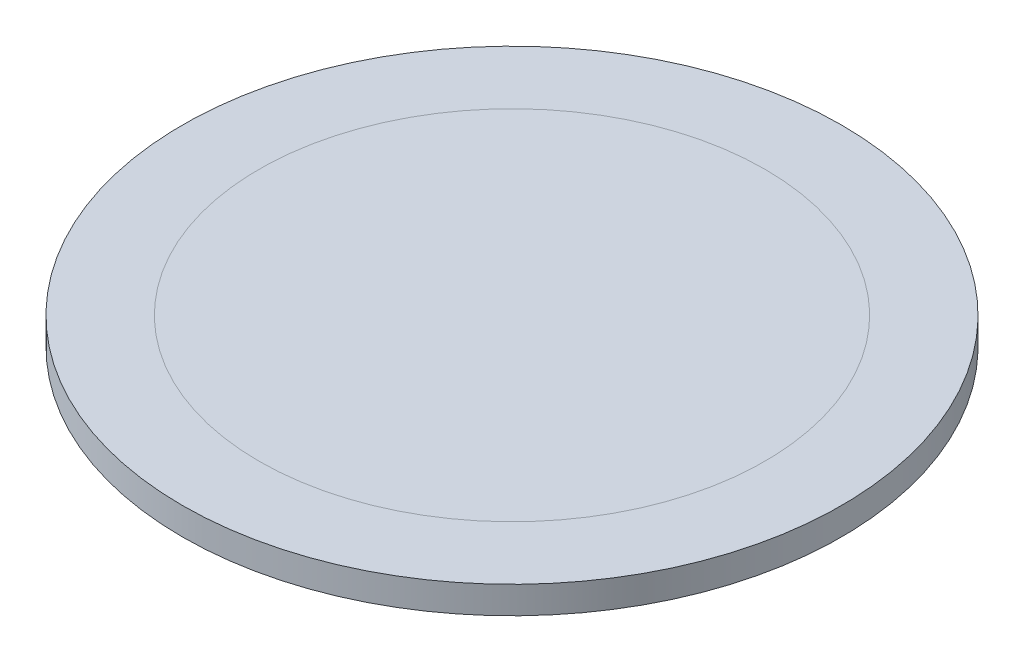
ISO-10303-21;
HEADER;
FILE_DESCRIPTION(('STEP AP214'),'2;1');
FILE_NAME('part.step','',(''),(''),'','','');
FILE_SCHEMA(('AUTOMOTIVE_DESIGN { 1 0 10303 214 1 1 1 1 }'));
ENDSEC;
DATA;
#1=APPLICATION_CONTEXT('core data for automotive mechanical design processes');
#2=APPLICATION_PROTOCOL_DEFINITION('international standard','automotive_design',2000,#1);
#3=PRODUCT_CONTEXT('',#1,'mechanical');
#4=PRODUCT('Part','Part','',(#3));
#5=PRODUCT_RELATED_PRODUCT_CATEGORY('part','',(#4));
#6=PRODUCT_DEFINITION_FORMATION('','',#4);
#7=PRODUCT_DEFINITION_CONTEXT('part definition',#1,'design');
#8=PRODUCT_DEFINITION('design','',#6,#7);
#9=PRODUCT_DEFINITION_SHAPE('','',#8);
#10=(LENGTH_UNIT() NAMED_UNIT(*) SI_UNIT(.MILLI.,.METRE.));
#11=(NAMED_UNIT(*) PLANE_ANGLE_UNIT() SI_UNIT($,.RADIAN.));
#12=(NAMED_UNIT(*) SI_UNIT($,.STERADIAN.) SOLID_ANGLE_UNIT());
#13=UNCERTAINTY_MEASURE_WITH_UNIT(LENGTH_MEASURE(1.E-05),#10,'distance_accuracy_value','');
#14=(GEOMETRIC_REPRESENTATION_CONTEXT(3) GLOBAL_UNCERTAINTY_ASSIGNED_CONTEXT((#13)) GLOBAL_UNIT_ASSIGNED_CONTEXT((#10,
#11,#12)) REPRESENTATION_CONTEXT('',''));
#15=CARTESIAN_POINT('',(0.,0.,0.));
#16=DIRECTION('',(0.,0.,1.));
#17=DIRECTION('',(1.,0.,0.));
#18=AXIS2_PLACEMENT_3D('',#15,#16,#17);
#19=CARTESIAN_POINT('',(-7.49999999999988,1.78,17.4281079622912));
#20=DIRECTION('',(0.,1.,0.));
#21=DIRECTION('',(0.,0.,1.));
#22=AXIS2_PLACEMENT_3D('',#19,#20,#21);
#23=PLANE('',#22);
#24=CARTESIAN_POINT('',(0.,1.78,0.));
#25=DIRECTION('',(0.,1.,0.));
#26=DIRECTION('',(0.,0.,1.));
#27=AXIS2_PLACEMENT_3D('',#24,#25,#26);
#28=CIRCLE('',#27,21.5);
#29=CARTESIAN_POINT('',(0.,1.78,21.5));
#30=VERTEX_POINT('',#29);
#31=EDGE_CURVE('E45',#30,#30,#28,.T.);
#32=ORIENTED_EDGE('',*,*,#31,.T.);
#33=EDGE_LOOP('',(#32));
#34=FACE_BOUND('',#33,.T.);
#35=CARTESIAN_POINT('',(0.,1.78,0.));
#36=DIRECTION('',(0.,1.,0.));
#37=DIRECTION('',(0.,0.,1.));
#38=AXIS2_PLACEMENT_3D('',#35,#36,#37);
#39=CIRCLE('',#38,16.5);
#40=CARTESIAN_POINT('',(0.,1.78,16.5));
#41=VERTEX_POINT('',#40);
#42=EDGE_CURVE('E10',#41,#41,#39,.F.);
#43=ORIENTED_EDGE('',*,*,#42,.T.);
#44=EDGE_LOOP('',(#43));
#45=FACE_BOUND('',#44,.T.);
#46=ADVANCED_FACE('F37',(#34,#45),#23,.T.);
#47=CARTESIAN_POINT('',(0.,67.5911831820431,0.));
#48=DIRECTION('',(0.,-1.,0.));
#49=DIRECTION('',(0.,0.,-1.));
#50=AXIS2_PLACEMENT_3D('',#47,#48,#49);
#51=CYLINDRICAL_SURFACE('',#50,21.5);
#52=CARTESIAN_POINT('',(0.,0.,0.));
#53=DIRECTION('',(0.,1.,0.));
#54=DIRECTION('',(0.,0.,1.));
#55=AXIS2_PLACEMENT_3D('',#52,#53,#54);
#56=CIRCLE('',#55,21.5);
#57=CARTESIAN_POINT('',(0.,0.,21.5));
#58=VERTEX_POINT('',#57);
#59=EDGE_CURVE('E51',#58,#58,#56,.T.);
#60=ORIENTED_EDGE('',*,*,#59,.T.);
#61=EDGE_LOOP('',(#60));
#62=FACE_BOUND('',#61,.T.);
#63=ORIENTED_EDGE('',*,*,#31,.F.);
#64=EDGE_LOOP('',(#63));
#65=FACE_BOUND('',#64,.T.);
#66=ADVANCED_FACE('F58',(#62,#65),#51,.T.);
#67=CARTESIAN_POINT('',(0.,0.,0.));
#68=DIRECTION('',(0.,1.,0.));
#69=DIRECTION('',(0.,0.,1.));
#70=AXIS2_PLACEMENT_3D('',#67,#68,#69);
#71=PLANE('',#70);
#72=ORIENTED_EDGE('',*,*,#59,.F.);
#73=EDGE_LOOP('',(#72));
#74=FACE_BOUND('',#73,.T.);
#75=ADVANCED_FACE('F61',(#74),#71,.F.);
#76=ORIENTED_EDGE('',*,*,#42,.F.);
#77=EDGE_LOOP('',(#76));
#78=FACE_BOUND('',#77,.T.);
#79=ADVANCED_FACE('F39',(#78),#23,.T.);
#80=CLOSED_SHELL('',(#46,#66,#75,#79));
#81=MANIFOLD_SOLID_BREP('B2',#80);
#82=ADVANCED_BREP_SHAPE_REPRESENTATION('',(#18,#81),#14);
#83=SHAPE_DEFINITION_REPRESENTATION(#9,#82);
ENDSEC;
END-ISO-10303-21;
